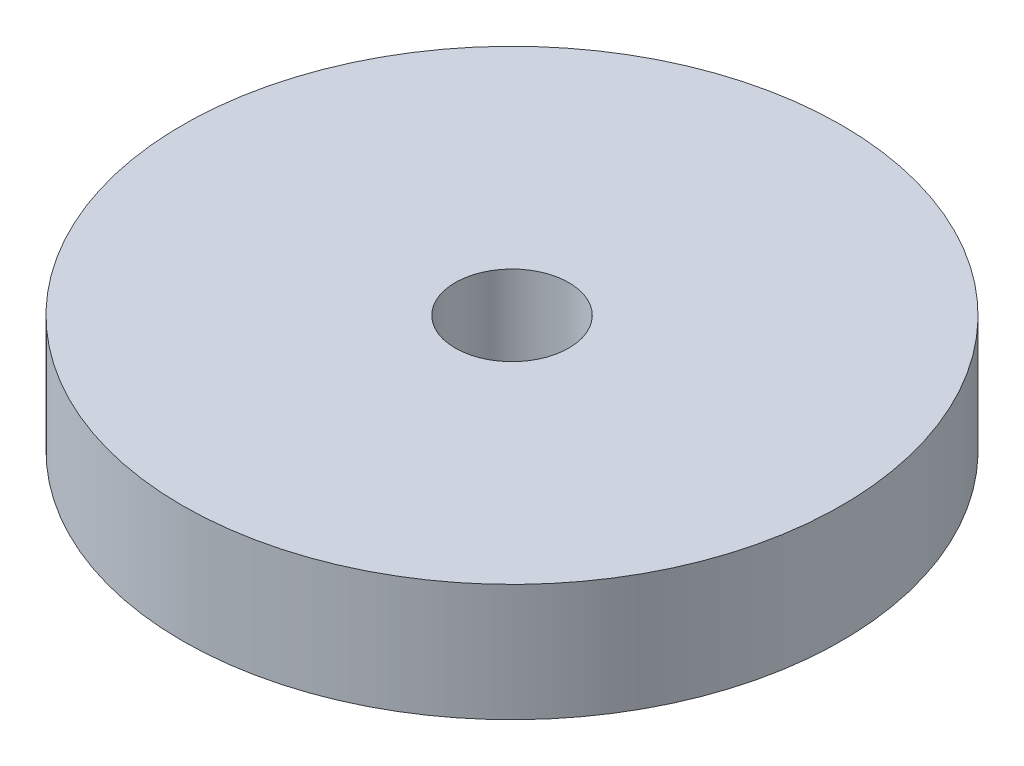
ISO-10303-21;
HEADER;
FILE_DESCRIPTION(('STEP AP214'),'2;1');
FILE_NAME('part.step','',(''),(''),'','','');
FILE_SCHEMA(('AUTOMOTIVE_DESIGN { 1 0 10303 214 1 1 1 1 }'));
ENDSEC;
DATA;
#1=APPLICATION_CONTEXT('core data for automotive mechanical design processes');
#2=APPLICATION_PROTOCOL_DEFINITION('international standard','automotive_design',2000,#1);
#3=PRODUCT_CONTEXT('',#1,'mechanical');
#4=PRODUCT('Part','Part','',(#3));
#5=PRODUCT_RELATED_PRODUCT_CATEGORY('part','',(#4));
#6=PRODUCT_DEFINITION_FORMATION('','',#4);
#7=PRODUCT_DEFINITION_CONTEXT('part definition',#1,'design');
#8=PRODUCT_DEFINITION('design','',#6,#7);
#9=PRODUCT_DEFINITION_SHAPE('','',#8);
#10=(LENGTH_UNIT() NAMED_UNIT(*) SI_UNIT(.MILLI.,.METRE.));
#11=(NAMED_UNIT(*) PLANE_ANGLE_UNIT() SI_UNIT($,.RADIAN.));
#12=(NAMED_UNIT(*) SI_UNIT($,.STERADIAN.) SOLID_ANGLE_UNIT());
#13=UNCERTAINTY_MEASURE_WITH_UNIT(LENGTH_MEASURE(1.E-05),#10,'distance_accuracy_value','');
#14=(GEOMETRIC_REPRESENTATION_CONTEXT(3) GLOBAL_UNCERTAINTY_ASSIGNED_CONTEXT((#13)) GLOBAL_UNIT_ASSIGNED_CONTEXT((#10,
#11,#12)) REPRESENTATION_CONTEXT('',''));
#15=CARTESIAN_POINT('',(0.,0.,0.));
#16=DIRECTION('',(0.,0.,1.));
#17=DIRECTION('',(1.,0.,0.));
#18=AXIS2_PLACEMENT_3D('',#15,#16,#17);
#19=CARTESIAN_POINT('',(0.,88.9,0.));
#20=DIRECTION('',(0.,1.,0.));
#21=DIRECTION('',(0.,0.,1.));
#22=AXIS2_PLACEMENT_3D('',#19,#20,#21);
#23=PLANE('',#22);
#24=CARTESIAN_POINT('',(0.,88.9,0.));
#25=DIRECTION('',(0.,1.,0.));
#26=DIRECTION('',(0.,0.,1.));
#27=AXIS2_PLACEMENT_3D('',#24,#25,#26);
#28=CIRCLE('',#27,250.);
#29=CARTESIAN_POINT('',(0.,88.9,250.));
#30=VERTEX_POINT('',#29);
#31=EDGE_CURVE('E10',#30,#30,#28,.T.);
#32=ORIENTED_EDGE('',*,*,#31,.T.);
#33=EDGE_LOOP('',(#32));
#34=FACE_BOUND('',#33,.T.);
#35=CARTESIAN_POINT('',(0.,88.9,0.));
#36=DIRECTION('',(0.,1.,0.));
#37=DIRECTION('',(0.,0.,1.));
#38=AXIS2_PLACEMENT_3D('',#35,#36,#37);
#39=CIRCLE('',#38,43.075);
#40=CARTESIAN_POINT('',(0.,88.9,43.075));
#41=VERTEX_POINT('',#40);
#42=EDGE_CURVE('E50',#41,#41,#39,.T.);
#43=ORIENTED_EDGE('',*,*,#42,.F.);
#44=EDGE_LOOP('',(#43));
#45=FACE_BOUND('',#44,.T.);
#46=ADVANCED_FACE('F37',(#34,#45),#23,.T.);
#47=CARTESIAN_POINT('',(0.,0.,0.));
#48=DIRECTION('',(0.,1.,0.));
#49=DIRECTION('',(0.,0.,1.));
#50=AXIS2_PLACEMENT_3D('',#47,#48,#49);
#51=PLANE('',#50);
#52=CARTESIAN_POINT('',(0.,0.,0.));
#53=DIRECTION('',(0.,1.,0.));
#54=DIRECTION('',(0.,0.,1.));
#55=AXIS2_PLACEMENT_3D('',#52,#53,#54);
#56=CIRCLE('',#55,250.);
#57=CARTESIAN_POINT('',(0.,0.,250.));
#58=VERTEX_POINT('',#57);
#59=EDGE_CURVE('E41',#58,#58,#56,.T.);
#60=ORIENTED_EDGE('',*,*,#59,.F.);
#61=EDGE_LOOP('',(#60));
#62=FACE_BOUND('',#61,.T.);
#63=CARTESIAN_POINT('',(0.,0.,0.));
#64=DIRECTION('',(0.,1.,0.));
#65=DIRECTION('',(0.,0.,1.));
#66=AXIS2_PLACEMENT_3D('',#63,#64,#65);
#67=CIRCLE('',#66,43.075);
#68=CARTESIAN_POINT('',(0.,0.,43.075));
#69=VERTEX_POINT('',#68);
#70=EDGE_CURVE('E52',#69,#69,#67,.T.);
#71=ORIENTED_EDGE('',*,*,#70,.T.);
#72=EDGE_LOOP('',(#71));
#73=FACE_BOUND('',#72,.T.);
#74=ADVANCED_FACE('F64',(#62,#73),#51,.F.);
#75=CARTESIAN_POINT('',(0.,88.9,0.));
#76=DIRECTION('',(0.,-1.,0.));
#77=DIRECTION('',(0.,0.,-1.));
#78=AXIS2_PLACEMENT_3D('',#75,#76,#77);
#79=CYLINDRICAL_SURFACE('',#78,250.);
#80=ORIENTED_EDGE('',*,*,#31,.F.);
#81=EDGE_LOOP('',(#80));
#82=FACE_BOUND('',#81,.T.);
#83=ORIENTED_EDGE('',*,*,#59,.T.);
#84=EDGE_LOOP('',(#83));
#85=FACE_BOUND('',#84,.T.);
#86=ADVANCED_FACE('F39',(#82,#85),#79,.T.);
#87=CARTESIAN_POINT('',(0.,88.9,0.));
#88=DIRECTION('',(0.,-1.,0.));
#89=DIRECTION('',(0.,0.,-1.));
#90=AXIS2_PLACEMENT_3D('',#87,#88,#89);
#91=CYLINDRICAL_SURFACE('',#90,43.075);
#92=ORIENTED_EDGE('',*,*,#42,.T.);
#93=EDGE_LOOP('',(#92));
#94=FACE_BOUND('',#93,.T.);
#95=ORIENTED_EDGE('',*,*,#70,.F.);
#96=EDGE_LOOP('',(#95));
#97=FACE_BOUND('',#96,.T.);
#98=ADVANCED_FACE('F60',(#94,#97),#91,.F.);
#99=CLOSED_SHELL('',(#46,#74,#86,#98));
#100=MANIFOLD_SOLID_BREP('B2',#99);
#101=ADVANCED_BREP_SHAPE_REPRESENTATION('',(#18,#100),#14);
#102=SHAPE_DEFINITION_REPRESENTATION(#9,#101);
ENDSEC;
END-ISO-10303-21;
